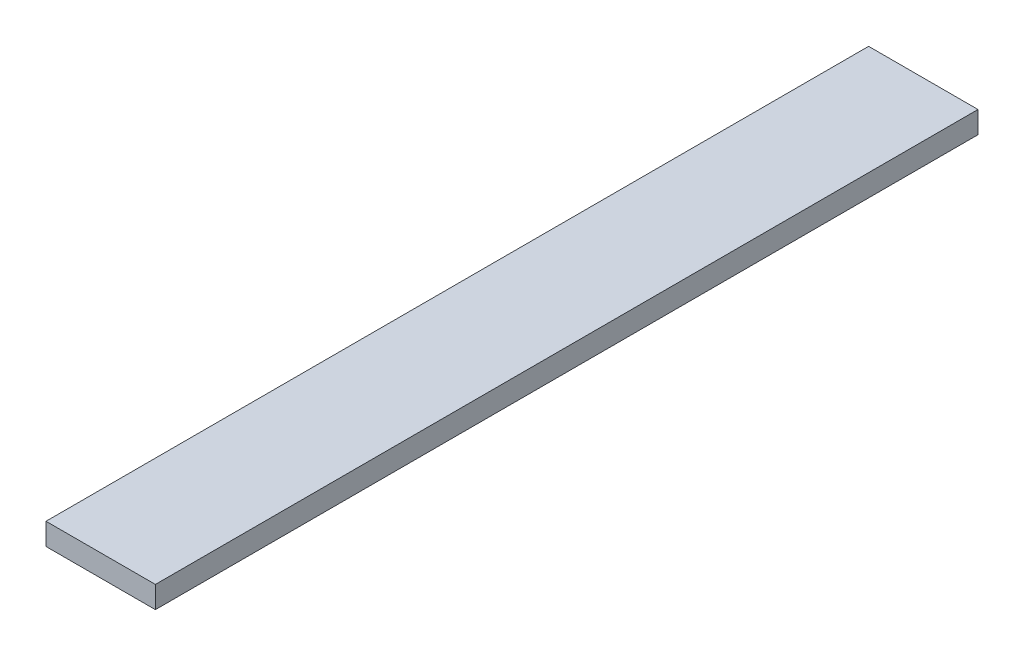
ISO-10303-21;
HEADER;
FILE_DESCRIPTION(('STEP AP214'),'2;1');
FILE_NAME('part.step','',(''),(''),'','','');
FILE_SCHEMA(('AUTOMOTIVE_DESIGN { 1 0 10303 214 1 1 1 1 }'));
ENDSEC;
DATA;
#1=APPLICATION_CONTEXT('core data for automotive mechanical design processes');
#2=APPLICATION_PROTOCOL_DEFINITION('international standard','automotive_design',2000,#1);
#3=PRODUCT_CONTEXT('',#1,'mechanical');
#4=PRODUCT('Part','Part','',(#3));
#5=PRODUCT_RELATED_PRODUCT_CATEGORY('part','',(#4));
#6=PRODUCT_DEFINITION_FORMATION('','',#4);
#7=PRODUCT_DEFINITION_CONTEXT('part definition',#1,'design');
#8=PRODUCT_DEFINITION('design','',#6,#7);
#9=PRODUCT_DEFINITION_SHAPE('','',#8);
#10=(LENGTH_UNIT() NAMED_UNIT(*) SI_UNIT(.MILLI.,.METRE.));
#11=(NAMED_UNIT(*) PLANE_ANGLE_UNIT() SI_UNIT($,.RADIAN.));
#12=(NAMED_UNIT(*) SI_UNIT($,.STERADIAN.) SOLID_ANGLE_UNIT());
#13=UNCERTAINTY_MEASURE_WITH_UNIT(LENGTH_MEASURE(1.E-05),#10,'distance_accuracy_value','');
#14=(GEOMETRIC_REPRESENTATION_CONTEXT(3) GLOBAL_UNCERTAINTY_ASSIGNED_CONTEXT((#13)) GLOBAL_UNIT_ASSIGNED_CONTEXT((#10,
#11,#12)) REPRESENTATION_CONTEXT('',''));
#15=CARTESIAN_POINT('',(0.,0.,0.));
#16=DIRECTION('',(0.,0.,1.));
#17=DIRECTION('',(1.,0.,0.));
#18=AXIS2_PLACEMENT_3D('',#15,#16,#17);
#19=CARTESIAN_POINT('',(0.,2.02999999999,0.));
#20=DIRECTION('',(0.,1.,0.));
#21=DIRECTION('',(-1.,0.,0.));
#22=AXIS2_PLACEMENT_3D('',#19,#20,#21);
#23=PLANE('',#22);
#24=DIRECTION('',(-1.,0.,0.));
#25=VECTOR('',#24,1.);
#26=CARTESIAN_POINT('',(0.,2.02999999999,0.195));
#27=LINE('',#26,#25);
#28=CARTESIAN_POINT('',(-0.625,2.02999999999,0.195));
#29=VERTEX_POINT('',#28);
#30=CARTESIAN_POINT('',(-0.875,2.02999999999,0.195));
#31=VERTEX_POINT('',#30);
#32=EDGE_CURVE('E19',#29,#31,#27,.T.);
#33=ORIENTED_EDGE('',*,*,#32,.F.);
#34=DIRECTION('',(0.,0.,1.));
#35=VECTOR('',#34,1.);
#36=CARTESIAN_POINT('',(-0.625,2.02999999999,0.195));
#37=LINE('',#36,#35);
#38=CARTESIAN_POINT('',(-0.625,2.02999999999,2.075));
#39=VERTEX_POINT('',#38);
#40=EDGE_CURVE('E68',#29,#39,#37,.T.);
#41=ORIENTED_EDGE('',*,*,#40,.T.);
#42=DIRECTION('',(-1.,0.,0.));
#43=VECTOR('',#42,1.);
#44=CARTESIAN_POINT('',(-0.875,2.02999999999,2.075));
#45=LINE('',#44,#43);
#46=CARTESIAN_POINT('',(-0.875,2.02999999999,2.075));
#47=VERTEX_POINT('',#46);
#48=EDGE_CURVE('E55',#39,#47,#45,.T.);
#49=ORIENTED_EDGE('',*,*,#48,.T.);
#50=DIRECTION('',(0.,0.,1.));
#51=VECTOR('',#50,1.);
#52=CARTESIAN_POINT('',(-0.875,2.02999999999,0.195));
#53=LINE('',#52,#51);
#54=EDGE_CURVE('E61',#47,#31,#53,.F.);
#55=ORIENTED_EDGE('',*,*,#54,.T.);
#56=EDGE_LOOP('',(#33,#41,#49,#55));
#57=FACE_BOUND('',#56,.T.);
#58=ADVANCED_FACE('F16',(#57),#23,.F.);
#59=CARTESIAN_POINT('',(-0.875,2.07999999999,0.195));
#60=DIRECTION('',(1.,0.,0.));
#61=DIRECTION('',(0.,1.,0.));
#62=AXIS2_PLACEMENT_3D('',#59,#60,#61);
#63=PLANE('',#62);
#64=DIRECTION('',(0.,1.,0.));
#65=VECTOR('',#64,1.);
#66=CARTESIAN_POINT('',(-0.875,2.07999999999,2.075));
#67=LINE('',#66,#65);
#68=CARTESIAN_POINT('',(-0.875,2.07999999999,2.075));
#69=VERTEX_POINT('',#68);
#70=EDGE_CURVE('E63',#47,#69,#67,.T.);
#71=ORIENTED_EDGE('',*,*,#70,.T.);
#72=DIRECTION('',(0.,0.,1.));
#73=VECTOR('',#72,1.);
#74=CARTESIAN_POINT('',(-0.875,2.07999999999,0.));
#75=LINE('',#74,#73);
#76=CARTESIAN_POINT('',(-0.875,2.07999999999,0.195));
#77=VERTEX_POINT('',#76);
#78=EDGE_CURVE('E82',#77,#69,#75,.T.);
#79=ORIENTED_EDGE('',*,*,#78,.F.);
#80=DIRECTION('',(0.,1.,0.));
#81=VECTOR('',#80,1.);
#82=CARTESIAN_POINT('',(-0.875,2.07999999999,0.195));
#83=LINE('',#82,#81);
#84=EDGE_CURVE('E66',#77,#31,#83,.F.);
#85=ORIENTED_EDGE('',*,*,#84,.T.);
#86=ORIENTED_EDGE('',*,*,#54,.F.);
#87=EDGE_LOOP('',(#71,#79,#85,#86));
#88=FACE_BOUND('',#87,.T.);
#89=ADVANCED_FACE('F62',(#88),#63,.F.);
#90=CARTESIAN_POINT('',(-0.875,2.07999999999,2.075));
#91=DIRECTION('',(0.,0.,-1.));
#92=DIRECTION('',(-1.,0.,0.));
#93=AXIS2_PLACEMENT_3D('',#90,#91,#92);
#94=PLANE('',#93);
#95=DIRECTION('',(0.,-1.,0.));
#96=VECTOR('',#95,1.);
#97=CARTESIAN_POINT('',(-0.625,2.07999999999,2.075));
#98=LINE('',#97,#96);
#99=CARTESIAN_POINT('',(-0.625,2.07999999999,2.075));
#100=VERTEX_POINT('',#99);
#101=EDGE_CURVE('E70',#39,#100,#98,.F.);
#102=ORIENTED_EDGE('',*,*,#101,.T.);
#103=DIRECTION('',(-1.,0.,0.));
#104=VECTOR('',#103,1.);
#105=CARTESIAN_POINT('',(0.,2.07999999999,2.075));
#106=LINE('',#105,#104);
#107=EDGE_CURVE('E74',#69,#100,#106,.F.);
#108=ORIENTED_EDGE('',*,*,#107,.F.);
#109=ORIENTED_EDGE('',*,*,#70,.F.);
#110=ORIENTED_EDGE('',*,*,#48,.F.);
#111=EDGE_LOOP('',(#102,#108,#109,#110));
#112=FACE_BOUND('',#111,.T.);
#113=ADVANCED_FACE('F72',(#112),#94,.F.);
#114=CARTESIAN_POINT('',(-0.625,2.07999999999,0.195));
#115=DIRECTION('',(-1.,0.,0.));
#116=DIRECTION('',(0.,-1.,0.));
#117=AXIS2_PLACEMENT_3D('',#114,#115,#116);
#118=PLANE('',#117);
#119=DIRECTION('',(0.,1.,0.));
#120=VECTOR('',#119,1.);
#121=CARTESIAN_POINT('',(-0.625,2.07999999999,0.195));
#122=LINE('',#121,#120);
#123=CARTESIAN_POINT('',(-0.625,2.07999999999,0.195));
#124=VERTEX_POINT('',#123);
#125=EDGE_CURVE('E34',#29,#124,#122,.T.);
#126=ORIENTED_EDGE('',*,*,#125,.T.);
#127=DIRECTION('',(0.,0.,1.));
#128=VECTOR('',#127,1.);
#129=CARTESIAN_POINT('',(-0.625,2.07999999999,0.));
#130=LINE('',#129,#128);
#131=EDGE_CURVE('E25',#100,#124,#130,.F.);
#132=ORIENTED_EDGE('',*,*,#131,.F.);
#133=ORIENTED_EDGE('',*,*,#101,.F.);
#134=ORIENTED_EDGE('',*,*,#40,.F.);
#135=EDGE_LOOP('',(#126,#132,#133,#134));
#136=FACE_BOUND('',#135,.T.);
#137=ADVANCED_FACE('F88',(#136),#118,.F.);
#138=CARTESIAN_POINT('',(-0.875,2.07999999999,0.195));
#139=DIRECTION('',(0.,0.,1.));
#140=DIRECTION('',(1.,0.,0.));
#141=AXIS2_PLACEMENT_3D('',#138,#139,#140);
#142=PLANE('',#141);
#143=ORIENTED_EDGE('',*,*,#84,.F.);
#144=DIRECTION('',(-1.,0.,0.));
#145=VECTOR('',#144,1.);
#146=CARTESIAN_POINT('',(0.,2.07999999999,0.195));
#147=LINE('',#146,#145);
#148=EDGE_CURVE('E11',#124,#77,#147,.T.);
#149=ORIENTED_EDGE('',*,*,#148,.F.);
#150=ORIENTED_EDGE('',*,*,#125,.F.);
#151=ORIENTED_EDGE('',*,*,#32,.T.);
#152=EDGE_LOOP('',(#143,#149,#150,#151));
#153=FACE_BOUND('',#152,.T.);
#154=ADVANCED_FACE('F90',(#153),#142,.F.);
#155=CARTESIAN_POINT('',(0.,2.07999999999,0.));
#156=DIRECTION('',(0.,1.,0.));
#157=DIRECTION('',(-1.,0.,0.));
#158=AXIS2_PLACEMENT_3D('',#155,#156,#157);
#159=PLANE('',#158);
#160=ORIENTED_EDGE('',*,*,#131,.T.);
#161=ORIENTED_EDGE('',*,*,#148,.T.);
#162=ORIENTED_EDGE('',*,*,#78,.T.);
#163=ORIENTED_EDGE('',*,*,#107,.T.);
#164=EDGE_LOOP('',(#160,#161,#162,#163));
#165=FACE_BOUND('',#164,.T.);
#166=ADVANCED_FACE('F87',(#165),#159,.T.);
#167=CLOSED_SHELL('',(#58,#89,#113,#137,#154,#166));
#168=MANIFOLD_SOLID_BREP('B1',#167);
#169=ADVANCED_BREP_SHAPE_REPRESENTATION('',(#18,#168),#14);
#170=SHAPE_DEFINITION_REPRESENTATION(#9,#169);
ENDSEC;
END-ISO-10303-21;
